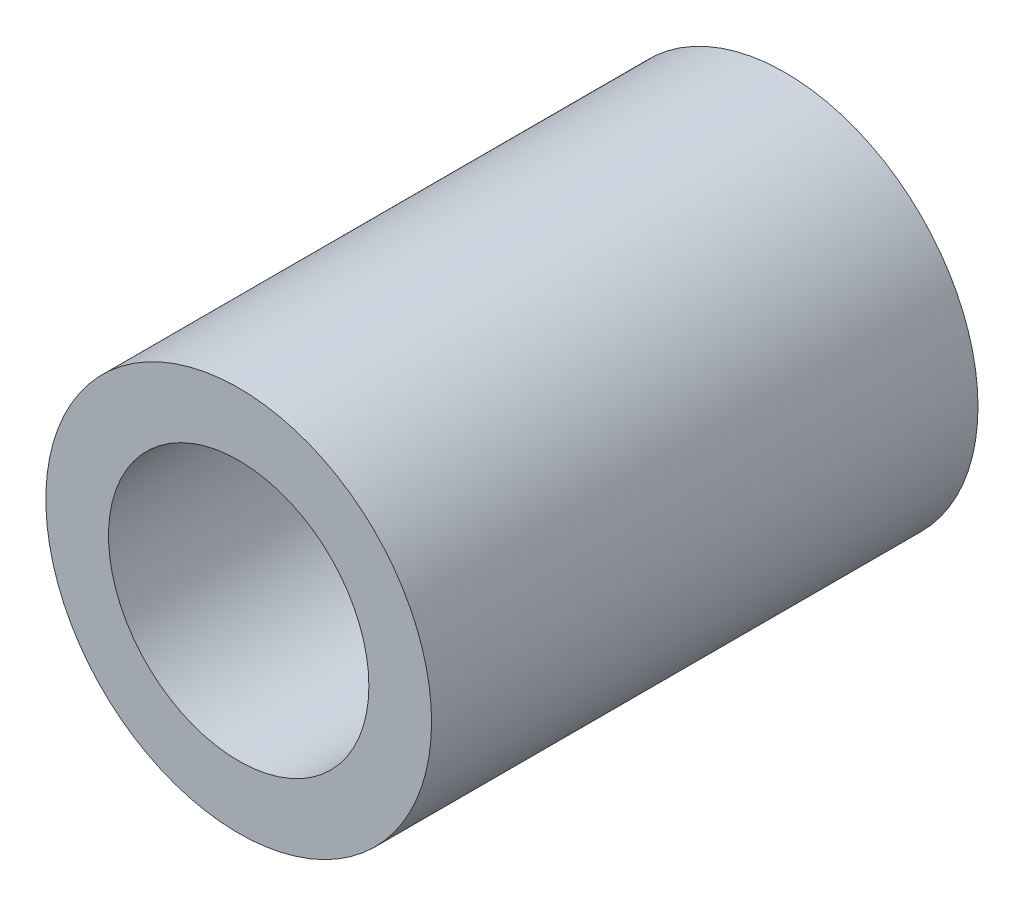
ISO-10303-21;
HEADER;
FILE_DESCRIPTION(('STEP AP214'),'2;1');
FILE_NAME('part.step','',(''),(''),'','','');
FILE_SCHEMA(('AUTOMOTIVE_DESIGN { 1 0 10303 214 1 1 1 1 }'));
ENDSEC;
DATA;
#1=APPLICATION_CONTEXT('core data for automotive mechanical design processes');
#2=APPLICATION_PROTOCOL_DEFINITION('international standard','automotive_design',2000,#1);
#3=PRODUCT_CONTEXT('',#1,'mechanical');
#4=PRODUCT('Part','Part','',(#3));
#5=PRODUCT_RELATED_PRODUCT_CATEGORY('part','',(#4));
#6=PRODUCT_DEFINITION_FORMATION('','',#4);
#7=PRODUCT_DEFINITION_CONTEXT('part definition',#1,'design');
#8=PRODUCT_DEFINITION('design','',#6,#7);
#9=PRODUCT_DEFINITION_SHAPE('','',#8);
#10=(LENGTH_UNIT() NAMED_UNIT(*) SI_UNIT(.MILLI.,.METRE.));
#11=(NAMED_UNIT(*) PLANE_ANGLE_UNIT() SI_UNIT($,.RADIAN.));
#12=(NAMED_UNIT(*) SI_UNIT($,.STERADIAN.) SOLID_ANGLE_UNIT());
#13=UNCERTAINTY_MEASURE_WITH_UNIT(LENGTH_MEASURE(1.E-05),#10,'distance_accuracy_value','');
#14=(GEOMETRIC_REPRESENTATION_CONTEXT(3) GLOBAL_UNCERTAINTY_ASSIGNED_CONTEXT((#13)) GLOBAL_UNIT_ASSIGNED_CONTEXT((#10,
#11,#12)) REPRESENTATION_CONTEXT('',''));
#15=CARTESIAN_POINT('',(0.,0.,0.));
#16=DIRECTION('',(0.,0.,1.));
#17=DIRECTION('',(1.,0.,0.));
#18=AXIS2_PLACEMENT_3D('',#15,#16,#17);
#19=CARTESIAN_POINT('',(0.,0.,4.25));
#20=DIRECTION('',(0.,0.,1.));
#21=DIRECTION('',(1.,0.,0.));
#22=AXIS2_PLACEMENT_3D('',#19,#20,#21);
#23=PLANE('',#22);
#24=CARTESIAN_POINT('',(0.,0.,4.25));
#25=DIRECTION('',(0.,0.,1.));
#26=DIRECTION('',(1.,0.,0.));
#27=AXIS2_PLACEMENT_3D('',#24,#25,#26);
#28=CIRCLE('',#27,3.);
#29=CARTESIAN_POINT('',(3.,0.,4.25));
#30=VERTEX_POINT('',#29);
#31=EDGE_CURVE('E10',#30,#30,#28,.T.);
#32=ORIENTED_EDGE('',*,*,#31,.T.);
#33=EDGE_LOOP('',(#32));
#34=FACE_BOUND('',#33,.T.);
#35=CARTESIAN_POINT('',(0.,0.,4.25));
#36=DIRECTION('',(0.,0.,1.));
#37=DIRECTION('',(1.,0.,0.));
#38=AXIS2_PLACEMENT_3D('',#35,#36,#37);
#39=CIRCLE('',#38,2.025);
#40=CARTESIAN_POINT('',(2.025,0.,4.25));
#41=VERTEX_POINT('',#40);
#42=EDGE_CURVE('E41',#41,#41,#39,.T.);
#43=ORIENTED_EDGE('',*,*,#42,.F.);
#44=EDGE_LOOP('',(#43));
#45=FACE_BOUND('',#44,.T.);
#46=ADVANCED_FACE('F30',(#34,#45),#23,.T.);
#47=CARTESIAN_POINT('',(0.,0.,-4.25));
#48=DIRECTION('',(0.,0.,1.));
#49=DIRECTION('',(1.,0.,0.));
#50=AXIS2_PLACEMENT_3D('',#47,#48,#49);
#51=PLANE('',#50);
#52=CARTESIAN_POINT('',(0.,0.,-4.25));
#53=DIRECTION('',(0.,0.,1.));
#54=DIRECTION('',(1.,0.,0.));
#55=AXIS2_PLACEMENT_3D('',#52,#53,#54);
#56=CIRCLE('',#55,3.);
#57=CARTESIAN_POINT('',(3.,0.,-4.25));
#58=VERTEX_POINT('',#57);
#59=EDGE_CURVE('E37',#58,#58,#56,.T.);
#60=ORIENTED_EDGE('',*,*,#59,.F.);
#61=EDGE_LOOP('',(#60));
#62=FACE_BOUND('',#61,.T.);
#63=CARTESIAN_POINT('',(0.,0.,-4.25));
#64=DIRECTION('',(0.,0.,1.));
#65=DIRECTION('',(1.,0.,0.));
#66=AXIS2_PLACEMENT_3D('',#63,#64,#65);
#67=CIRCLE('',#66,2.025);
#68=CARTESIAN_POINT('',(2.025,0.,-4.25));
#69=VERTEX_POINT('',#68);
#70=EDGE_CURVE('E45',#69,#69,#67,.T.);
#71=ORIENTED_EDGE('',*,*,#70,.T.);
#72=EDGE_LOOP('',(#71));
#73=FACE_BOUND('',#72,.T.);
#74=ADVANCED_FACE('F51',(#62,#73),#51,.F.);
#75=CARTESIAN_POINT('',(0.,0.,4.25));
#76=DIRECTION('',(0.,0.,-1.));
#77=DIRECTION('',(-1.,0.,0.));
#78=AXIS2_PLACEMENT_3D('',#75,#76,#77);
#79=CYLINDRICAL_SURFACE('',#78,3.);
#80=ORIENTED_EDGE('',*,*,#31,.F.);
#81=EDGE_LOOP('',(#80));
#82=FACE_BOUND('',#81,.T.);
#83=ORIENTED_EDGE('',*,*,#59,.T.);
#84=EDGE_LOOP('',(#83));
#85=FACE_BOUND('',#84,.T.);
#86=ADVANCED_FACE('F32',(#82,#85),#79,.T.);
#87=CARTESIAN_POINT('',(0.,0.,4.25));
#88=DIRECTION('',(0.,0.,-1.));
#89=DIRECTION('',(-1.,0.,0.));
#90=AXIS2_PLACEMENT_3D('',#87,#88,#89);
#91=CYLINDRICAL_SURFACE('',#90,2.025);
#92=ORIENTED_EDGE('',*,*,#42,.T.);
#93=EDGE_LOOP('',(#92));
#94=FACE_BOUND('',#93,.T.);
#95=ORIENTED_EDGE('',*,*,#70,.F.);
#96=EDGE_LOOP('',(#95));
#97=FACE_BOUND('',#96,.T.);
#98=ADVANCED_FACE('F53',(#94,#97),#91,.F.);
#99=CLOSED_SHELL('',(#46,#74,#86,#98));
#100=MANIFOLD_SOLID_BREP('B2',#99);
#101=ADVANCED_BREP_SHAPE_REPRESENTATION('',(#18,#100),#14);
#102=SHAPE_DEFINITION_REPRESENTATION(#9,#101);
ENDSEC;
END-ISO-10303-21;
